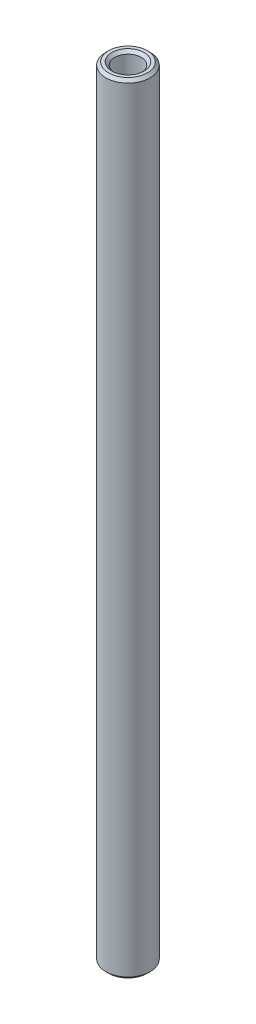
ISO-10303-21;
HEADER;
FILE_DESCRIPTION(('STEP AP214'),'2;1');
FILE_NAME('part.step','',(''),(''),'','','');
FILE_SCHEMA(('AUTOMOTIVE_DESIGN { 1 0 10303 214 1 1 1 1 }'));
ENDSEC;
DATA;
#1=APPLICATION_CONTEXT('core data for automotive mechanical design processes');
#2=APPLICATION_PROTOCOL_DEFINITION('international standard','automotive_design',2000,#1);
#3=PRODUCT_CONTEXT('',#1,'mechanical');
#4=PRODUCT('Part','Part','',(#3));
#5=PRODUCT_RELATED_PRODUCT_CATEGORY('part','',(#4));
#6=PRODUCT_DEFINITION_FORMATION('','',#4);
#7=PRODUCT_DEFINITION_CONTEXT('part definition',#1,'design');
#8=PRODUCT_DEFINITION('design','',#6,#7);
#9=PRODUCT_DEFINITION_SHAPE('','',#8);
#10=(LENGTH_UNIT() NAMED_UNIT(*) SI_UNIT(.MILLI.,.METRE.));
#11=(NAMED_UNIT(*) PLANE_ANGLE_UNIT() SI_UNIT($,.RADIAN.));
#12=(NAMED_UNIT(*) SI_UNIT($,.STERADIAN.) SOLID_ANGLE_UNIT());
#13=UNCERTAINTY_MEASURE_WITH_UNIT(LENGTH_MEASURE(1.E-05),#10,'distance_accuracy_value','');
#14=(GEOMETRIC_REPRESENTATION_CONTEXT(3) GLOBAL_UNCERTAINTY_ASSIGNED_CONTEXT((#13)) GLOBAL_UNIT_ASSIGNED_CONTEXT((#10,
#11,#12)) REPRESENTATION_CONTEXT('',''));
#15=CARTESIAN_POINT('',(0.,0.,0.));
#16=DIRECTION('',(0.,0.,1.));
#17=DIRECTION('',(1.,0.,0.));
#18=AXIS2_PLACEMENT_3D('',#15,#16,#17);
#19=CARTESIAN_POINT('',(0.,34.925,0.));
#20=DIRECTION('',(0.,1.,0.));
#21=DIRECTION('',(0.,0.,1.));
#22=AXIS2_PLACEMENT_3D('',#19,#20,#21);
#23=PLANE('',#22);
#24=CARTESIAN_POINT('',(0.,34.925,0.));
#25=DIRECTION('',(0.,1.,0.));
#26=DIRECTION('',(0.,0.,1.));
#27=AXIS2_PLACEMENT_3D('',#24,#25,#26);
#28=CIRCLE('',#27,1.44462500000001);
#29=CARTESIAN_POINT('',(0.,34.925,1.44462500000001));
#30=VERTEX_POINT('',#29);
#31=EDGE_CURVE('E10',#30,#30,#28,.F.);
#32=ORIENTED_EDGE('',*,*,#31,.T.);
#33=EDGE_LOOP('',(#32));
#34=FACE_BOUND('',#33,.T.);
#35=CARTESIAN_POINT('',(0.,34.925,0.));
#36=DIRECTION('',(0.,1.,0.));
#37=DIRECTION('',(0.,0.,1.));
#38=AXIS2_PLACEMENT_3D('',#35,#36,#37);
#39=CIRCLE('',#38,1.730375);
#40=CARTESIAN_POINT('',(0.,34.925,1.730375));
#41=VERTEX_POINT('',#40);
#42=EDGE_CURVE('E41',#41,#41,#39,.T.);
#43=ORIENTED_EDGE('',*,*,#42,.T.);
#44=EDGE_LOOP('',(#43));
#45=FACE_BOUND('',#44,.T.);
#46=ADVANCED_FACE('F33',(#34,#45),#23,.T.);
#47=CARTESIAN_POINT('',(0.,-34.925,0.));
#48=DIRECTION('',(0.,1.,0.));
#49=DIRECTION('',(0.,0.,1.));
#50=AXIS2_PLACEMENT_3D('',#47,#48,#49);
#51=PLANE('',#50);
#52=CARTESIAN_POINT('',(0.,-34.925,0.));
#53=DIRECTION('',(0.,1.,0.));
#54=DIRECTION('',(0.,0.,1.));
#55=AXIS2_PLACEMENT_3D('',#52,#53,#54);
#56=CIRCLE('',#55,1.44462499999999);
#57=CARTESIAN_POINT('',(0.,-34.925,1.44462499999999));
#58=VERTEX_POINT('',#57);
#59=EDGE_CURVE('E60',#58,#58,#56,.T.);
#60=ORIENTED_EDGE('',*,*,#59,.T.);
#61=EDGE_LOOP('',(#60));
#62=FACE_BOUND('',#61,.T.);
#63=CARTESIAN_POINT('',(0.,-34.925,0.));
#64=DIRECTION('',(0.,1.,0.));
#65=DIRECTION('',(0.,0.,1.));
#66=AXIS2_PLACEMENT_3D('',#63,#64,#65);
#67=CIRCLE('',#66,1.73037500000001);
#68=CARTESIAN_POINT('',(0.,-34.925,1.73037500000001));
#69=VERTEX_POINT('',#68);
#70=EDGE_CURVE('E63',#69,#69,#67,.F.);
#71=ORIENTED_EDGE('',*,*,#70,.T.);
#72=EDGE_LOOP('',(#71));
#73=FACE_BOUND('',#72,.T.);
#74=ADVANCED_FACE('F67',(#62,#73),#51,.F.);
#75=CARTESIAN_POINT('',(0.,34.925,0.));
#76=DIRECTION('',(0.,-1.,0.));
#77=DIRECTION('',(0.,0.,-1.));
#78=AXIS2_PLACEMENT_3D('',#75,#76,#77);
#79=CYLINDRICAL_SURFACE('',#78,1.984375);
#80=CARTESIAN_POINT('',(0.,-34.671,0.));
#81=DIRECTION('',(0.,1.,0.));
#82=DIRECTION('',(0.,0.,1.));
#83=AXIS2_PLACEMENT_3D('',#80,#81,#82);
#84=CIRCLE('',#83,1.984375);
#85=CARTESIAN_POINT('',(0.,-34.671,1.984375));
#86=VERTEX_POINT('',#85);
#87=EDGE_CURVE('E45',#86,#86,#84,.T.);
#88=ORIENTED_EDGE('',*,*,#87,.T.);
#89=EDGE_LOOP('',(#88));
#90=FACE_BOUND('',#89,.T.);
#91=CARTESIAN_POINT('',(0.,34.671,0.));
#92=DIRECTION('',(0.,1.,0.));
#93=DIRECTION('',(0.,0.,1.));
#94=AXIS2_PLACEMENT_3D('',#91,#92,#93);
#95=CIRCLE('',#94,1.984375);
#96=CARTESIAN_POINT('',(0.,34.671,1.984375));
#97=VERTEX_POINT('',#96);
#98=EDGE_CURVE('E49',#97,#97,#95,.F.);
#99=ORIENTED_EDGE('',*,*,#98,.T.);
#100=EDGE_LOOP('',(#99));
#101=FACE_BOUND('',#100,.T.);
#102=ADVANCED_FACE('F77',(#90,#101),#79,.T.);
#103=CARTESIAN_POINT('',(0.,34.925,0.));
#104=DIRECTION('',(0.,-1.,0.));
#105=DIRECTION('',(0.,0.,-1.));
#106=AXIS2_PLACEMENT_3D('',#103,#104,#105);
#107=CYLINDRICAL_SURFACE('',#106,1.190625);
#108=CARTESIAN_POINT('',(0.,-34.671,0.));
#109=DIRECTION('',(0.,1.,0.));
#110=DIRECTION('',(0.,0.,1.));
#111=AXIS2_PLACEMENT_3D('',#108,#109,#110);
#112=CIRCLE('',#111,1.190625);
#113=CARTESIAN_POINT('',(0.,-34.671,1.190625));
#114=VERTEX_POINT('',#113);
#115=EDGE_CURVE('E54',#114,#114,#112,.F.);
#116=ORIENTED_EDGE('',*,*,#115,.T.);
#117=EDGE_LOOP('',(#116));
#118=FACE_BOUND('',#117,.T.);
#119=CARTESIAN_POINT('',(0.,34.671,0.));
#120=DIRECTION('',(0.,1.,0.));
#121=DIRECTION('',(0.,0.,1.));
#122=AXIS2_PLACEMENT_3D('',#119,#120,#121);
#123=CIRCLE('',#122,1.190625);
#124=CARTESIAN_POINT('',(0.,34.671,1.190625));
#125=VERTEX_POINT('',#124);
#126=EDGE_CURVE('E57',#125,#125,#123,.T.);
#127=ORIENTED_EDGE('',*,*,#126,.T.);
#128=EDGE_LOOP('',(#127));
#129=FACE_BOUND('',#128,.T.);
#130=ADVANCED_FACE('F80',(#118,#129),#107,.F.);
#131=CARTESIAN_POINT('',(0.,-34.925,0.));
#132=DIRECTION('',(0.,-1.,0.));
#133=DIRECTION('',(0.,0.,-1.));
#134=AXIS2_PLACEMENT_3D('',#131,#132,#133);
#135=CONICAL_SURFACE('',#134,1.44462499999999,0.78539816339745);
#136=ORIENTED_EDGE('',*,*,#115,.F.);
#137=EDGE_LOOP('',(#136));
#138=FACE_BOUND('',#137,.T.);
#139=ORIENTED_EDGE('',*,*,#59,.F.);
#140=EDGE_LOOP('',(#139));
#141=FACE_BOUND('',#140,.T.);
#142=ADVANCED_FACE('F73',(#138,#141),#135,.F.);
#143=CARTESIAN_POINT('',(0.,-34.671,0.));
#144=DIRECTION('',(0.,1.,0.));
#145=DIRECTION('',(0.,0.,1.));
#146=AXIS2_PLACEMENT_3D('',#143,#144,#145);
#147=CONICAL_SURFACE('',#146,1.984375,0.785398163397442);
#148=ORIENTED_EDGE('',*,*,#70,.F.);
#149=EDGE_LOOP('',(#148));
#150=FACE_BOUND('',#149,.T.);
#151=ORIENTED_EDGE('',*,*,#87,.F.);
#152=EDGE_LOOP('',(#151));
#153=FACE_BOUND('',#152,.T.);
#154=ADVANCED_FACE('F69',(#150,#153),#147,.T.);
#155=CARTESIAN_POINT('',(0.,34.671,0.));
#156=DIRECTION('',(0.,1.,0.));
#157=DIRECTION('',(0.,0.,1.));
#158=AXIS2_PLACEMENT_3D('',#155,#156,#157);
#159=CONICAL_SURFACE('',#158,1.190625,0.78539816339745);
#160=ORIENTED_EDGE('',*,*,#31,.F.);
#161=EDGE_LOOP('',(#160));
#162=FACE_BOUND('',#161,.T.);
#163=ORIENTED_EDGE('',*,*,#126,.F.);
#164=EDGE_LOOP('',(#163));
#165=FACE_BOUND('',#164,.T.);
#166=ADVANCED_FACE('F72',(#162,#165),#159,.F.);
#167=CARTESIAN_POINT('',(0.,34.925,0.));
#168=DIRECTION('',(0.,-1.,0.));
#169=DIRECTION('',(0.,0.,-1.));
#170=AXIS2_PLACEMENT_3D('',#167,#168,#169);
#171=CONICAL_SURFACE('',#170,1.730375,0.785398163397442);
#172=ORIENTED_EDGE('',*,*,#98,.F.);
#173=EDGE_LOOP('',(#172));
#174=FACE_BOUND('',#173,.T.);
#175=ORIENTED_EDGE('',*,*,#42,.F.);
#176=EDGE_LOOP('',(#175));
#177=FACE_BOUND('',#176,.T.);
#178=ADVANCED_FACE('F36',(#174,#177),#171,.T.);
#179=CLOSED_SHELL('',(#46,#74,#102,#130,#142,#154,#166,#178));
#180=MANIFOLD_SOLID_BREP('B2',#179);
#181=ADVANCED_BREP_SHAPE_REPRESENTATION('',(#18,#180),#14);
#182=SHAPE_DEFINITION_REPRESENTATION(#9,#181);
ENDSEC;
END-ISO-10303-21;
